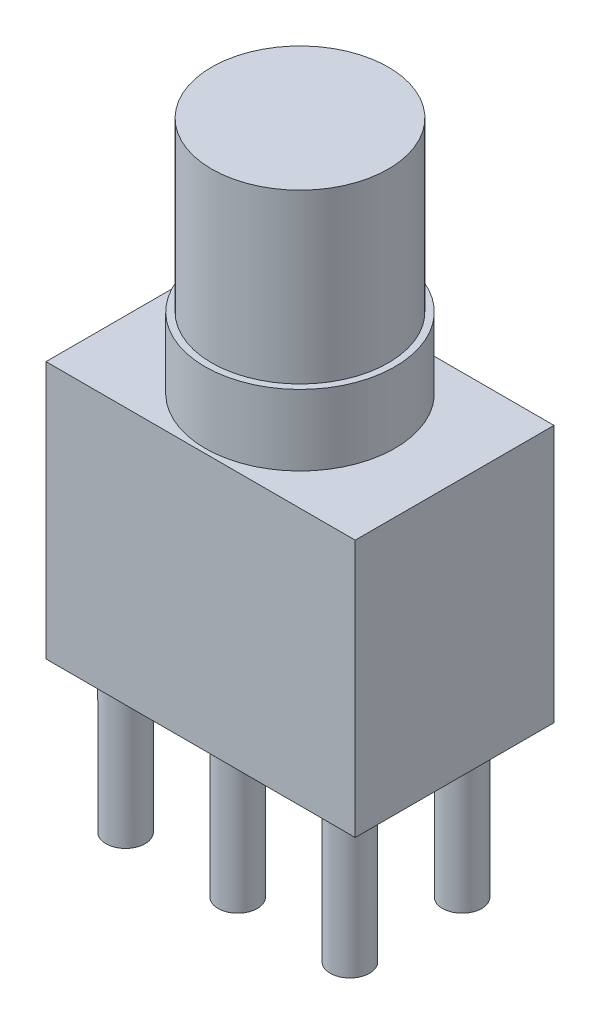
ISO-10303-21;
HEADER;
FILE_DESCRIPTION(('STEP AP214'),'2;1');
FILE_NAME('part.step','',(''),(''),'','','');
FILE_SCHEMA(('AUTOMOTIVE_DESIGN { 1 0 10303 214 1 1 1 1 }'));
ENDSEC;
DATA;
#1=APPLICATION_CONTEXT('core data for automotive mechanical design processes');
#2=APPLICATION_PROTOCOL_DEFINITION('international standard','automotive_design',2000,#1);
#3=PRODUCT_CONTEXT('',#1,'mechanical');
#4=PRODUCT('Part','Part','',(#3));
#5=PRODUCT_RELATED_PRODUCT_CATEGORY('part','',(#4));
#6=PRODUCT_DEFINITION_FORMATION('','',#4);
#7=PRODUCT_DEFINITION_CONTEXT('part definition',#1,'design');
#8=PRODUCT_DEFINITION('design','',#6,#7);
#9=PRODUCT_DEFINITION_SHAPE('','',#8);
#10=(LENGTH_UNIT() NAMED_UNIT(*) SI_UNIT(.MILLI.,.METRE.));
#11=(NAMED_UNIT(*) PLANE_ANGLE_UNIT() SI_UNIT($,.RADIAN.));
#12=(NAMED_UNIT(*) SI_UNIT($,.STERADIAN.) SOLID_ANGLE_UNIT());
#13=UNCERTAINTY_MEASURE_WITH_UNIT(LENGTH_MEASURE(1.E-05),#10,'distance_accuracy_value','');
#14=(GEOMETRIC_REPRESENTATION_CONTEXT(3) GLOBAL_UNCERTAINTY_ASSIGNED_CONTEXT((#13)) GLOBAL_UNIT_ASSIGNED_CONTEXT((#10,
#11,#12)) REPRESENTATION_CONTEXT('',''));
#15=CARTESIAN_POINT('',(0.,0.,0.));
#16=DIRECTION('',(0.,0.,1.));
#17=DIRECTION('',(1.,0.,0.));
#18=AXIS2_PLACEMENT_3D('',#15,#16,#17);
#19=CARTESIAN_POINT('',(0.,5.83,0.));
#20=DIRECTION('',(1.,0.,0.));
#21=DIRECTION('',(0.,0.,-1.));
#22=AXIS2_PLACEMENT_3D('',#19,#20,#21);
#23=PLANE('',#22);
#24=DIRECTION('',(0.,0.,1.));
#25=VECTOR('',#24,1.);
#26=CARTESIAN_POINT('',(0.,0.,0.));
#27=LINE('',#26,#25);
#28=CARTESIAN_POINT('',(0.,0.,0.));
#29=VERTEX_POINT('',#28);
#30=CARTESIAN_POINT('',(0.,0.,4.5));
#31=VERTEX_POINT('',#30);
#32=EDGE_CURVE('E100',#29,#31,#27,.T.);
#33=ORIENTED_EDGE('',*,*,#32,.T.);
#34=DIRECTION('',(0.,-1.,0.));
#35=VECTOR('',#34,1.);
#36=CARTESIAN_POINT('',(0.,5.83,4.5));
#37=LINE('',#36,#35);
#38=CARTESIAN_POINT('',(0.,5.83,4.5));
#39=VERTEX_POINT('',#38);
#40=EDGE_CURVE('E91',#39,#31,#37,.T.);
#41=ORIENTED_EDGE('',*,*,#40,.F.);
#42=DIRECTION('',(0.,0.,1.));
#43=VECTOR('',#42,1.);
#44=CARTESIAN_POINT('',(0.,5.83,0.));
#45=LINE('',#44,#43);
#46=CARTESIAN_POINT('',(0.,5.83,0.));
#47=VERTEX_POINT('',#46);
#48=EDGE_CURVE('E85',#47,#39,#45,.T.);
#49=ORIENTED_EDGE('',*,*,#48,.F.);
#50=DIRECTION('',(0.,-1.,0.));
#51=VECTOR('',#50,1.);
#52=CARTESIAN_POINT('',(0.,5.83,0.));
#53=LINE('',#52,#51);
#54=EDGE_CURVE('E96',#47,#29,#53,.T.);
#55=ORIENTED_EDGE('',*,*,#54,.T.);
#56=EDGE_LOOP('',(#33,#41,#49,#55));
#57=FACE_BOUND('',#56,.T.);
#58=ADVANCED_FACE('F33',(#57),#23,.F.);
#59=CARTESIAN_POINT('',(0.,5.83,4.5));
#60=DIRECTION('',(0.,0.,-1.));
#61=DIRECTION('',(-1.,0.,0.));
#62=AXIS2_PLACEMENT_3D('',#59,#60,#61);
#63=PLANE('',#62);
#64=DIRECTION('',(1.,0.,0.));
#65=VECTOR('',#64,1.);
#66=CARTESIAN_POINT('',(0.,0.,4.5));
#67=LINE('',#66,#65);
#68=CARTESIAN_POINT('',(7.,0.,4.5));
#69=VERTEX_POINT('',#68);
#70=EDGE_CURVE('E90',#31,#69,#67,.T.);
#71=ORIENTED_EDGE('',*,*,#70,.T.);
#72=DIRECTION('',(0.,-1.,0.));
#73=VECTOR('',#72,1.);
#74=CARTESIAN_POINT('',(7.,5.83,4.5));
#75=LINE('',#74,#73);
#76=CARTESIAN_POINT('',(7.,5.83,4.5));
#77=VERTEX_POINT('',#76);
#78=EDGE_CURVE('E88',#77,#69,#75,.T.);
#79=ORIENTED_EDGE('',*,*,#78,.F.);
#80=DIRECTION('',(1.,0.,0.));
#81=VECTOR('',#80,1.);
#82=CARTESIAN_POINT('',(0.,5.83,4.5));
#83=LINE('',#82,#81);
#84=EDGE_CURVE('E80',#39,#77,#83,.T.);
#85=ORIENTED_EDGE('',*,*,#84,.F.);
#86=ORIENTED_EDGE('',*,*,#40,.T.);
#87=EDGE_LOOP('',(#71,#79,#85,#86));
#88=FACE_BOUND('',#87,.T.);
#89=ADVANCED_FACE('F89',(#88),#63,.F.);
#90=CARTESIAN_POINT('',(7.,5.83,0.));
#91=DIRECTION('',(-1.,0.,0.));
#92=DIRECTION('',(0.,0.,1.));
#93=AXIS2_PLACEMENT_3D('',#90,#91,#92);
#94=PLANE('',#93);
#95=DIRECTION('',(0.,0.,-1.));
#96=VECTOR('',#95,1.);
#97=CARTESIAN_POINT('',(7.,0.,0.));
#98=LINE('',#97,#96);
#99=CARTESIAN_POINT('',(7.,0.,0.));
#100=VERTEX_POINT('',#99);
#101=EDGE_CURVE('E66',#69,#100,#98,.T.);
#102=ORIENTED_EDGE('',*,*,#101,.T.);
#103=DIRECTION('',(0.,-1.,0.));
#104=VECTOR('',#103,1.);
#105=CARTESIAN_POINT('',(7.,5.83,0.));
#106=LINE('',#105,#104);
#107=CARTESIAN_POINT('',(7.,5.83,0.));
#108=VERTEX_POINT('',#107);
#109=EDGE_CURVE('E92',#108,#100,#106,.T.);
#110=ORIENTED_EDGE('',*,*,#109,.F.);
#111=DIRECTION('',(0.,0.,-1.));
#112=VECTOR('',#111,1.);
#113=CARTESIAN_POINT('',(7.,5.83,0.));
#114=LINE('',#113,#112);
#115=EDGE_CURVE('E83',#77,#108,#114,.T.);
#116=ORIENTED_EDGE('',*,*,#115,.F.);
#117=ORIENTED_EDGE('',*,*,#78,.T.);
#118=EDGE_LOOP('',(#102,#110,#116,#117));
#119=FACE_BOUND('',#118,.T.);
#120=ADVANCED_FACE('F94',(#119),#94,.F.);
#121=CARTESIAN_POINT('',(0.,5.83,0.));
#122=DIRECTION('',(0.,0.,1.));
#123=DIRECTION('',(1.,0.,0.));
#124=AXIS2_PLACEMENT_3D('',#121,#122,#123);
#125=PLANE('',#124);
#126=DIRECTION('',(-1.,0.,0.));
#127=VECTOR('',#126,1.);
#128=CARTESIAN_POINT('',(0.,0.,0.));
#129=LINE('',#128,#127);
#130=EDGE_CURVE('E72',#100,#29,#129,.T.);
#131=ORIENTED_EDGE('',*,*,#130,.T.);
#132=ORIENTED_EDGE('',*,*,#54,.F.);
#133=DIRECTION('',(-1.,0.,0.));
#134=VECTOR('',#133,1.);
#135=CARTESIAN_POINT('',(0.,5.83,0.));
#136=LINE('',#135,#134);
#137=EDGE_CURVE('E49',#108,#47,#136,.T.);
#138=ORIENTED_EDGE('',*,*,#137,.F.);
#139=ORIENTED_EDGE('',*,*,#109,.T.);
#140=EDGE_LOOP('',(#131,#132,#138,#139));
#141=FACE_BOUND('',#140,.T.);
#142=ADVANCED_FACE('F144',(#141),#125,.F.);
#143=CARTESIAN_POINT('',(0.,5.83,0.));
#144=DIRECTION('',(0.,1.,0.));
#145=DIRECTION('',(0.,0.,1.));
#146=AXIS2_PLACEMENT_3D('',#143,#144,#145);
#147=PLANE('',#146);
#148=CARTESIAN_POINT('',(3.5,5.83,2.25));
#149=DIRECTION('',(0.,1.,0.));
#150=DIRECTION('',(0.,0.,1.));
#151=AXIS2_PLACEMENT_3D('',#148,#149,#150);
#152=CIRCLE('',#151,2.15);
#153=CARTESIAN_POINT('',(3.5,5.83,4.4));
#154=VERTEX_POINT('',#153);
#155=EDGE_CURVE('E110',#154,#154,#152,.T.);
#156=ORIENTED_EDGE('',*,*,#155,.F.);
#157=EDGE_LOOP('',(#156));
#158=FACE_BOUND('',#157,.T.);
#159=ORIENTED_EDGE('',*,*,#48,.T.);
#160=ORIENTED_EDGE('',*,*,#84,.T.);
#161=ORIENTED_EDGE('',*,*,#115,.T.);
#162=ORIENTED_EDGE('',*,*,#137,.T.);
#163=EDGE_LOOP('',(#159,#160,#161,#162));
#164=FACE_BOUND('',#163,.T.);
#165=ADVANCED_FACE('F81',(#158,#164),#147,.T.);
#166=CARTESIAN_POINT('',(0.,0.,0.));
#167=DIRECTION('',(0.,1.,0.));
#168=DIRECTION('',(0.,0.,1.));
#169=AXIS2_PLACEMENT_3D('',#166,#167,#168);
#170=PLANE('',#169);
#171=CARTESIAN_POINT('',(1.,0.,1.16));
#172=DIRECTION('',(0.,1.,0.));
#173=DIRECTION('',(0.,0.,1.));
#174=AXIS2_PLACEMENT_3D('',#171,#172,#173);
#175=CIRCLE('',#174,0.445000000000001);
#176=CARTESIAN_POINT('',(1.,0.,1.605));
#177=VERTEX_POINT('',#176);
#178=EDGE_CURVE('E11',#177,#177,#175,.F.);
#179=ORIENTED_EDGE('',*,*,#178,.F.);
#180=EDGE_LOOP('',(#179));
#181=FACE_BOUND('',#180,.T.);
#182=CARTESIAN_POINT('',(3.54,0.,1.16));
#183=DIRECTION('',(0.,1.,0.));
#184=DIRECTION('',(0.,0.,1.));
#185=AXIS2_PLACEMENT_3D('',#182,#183,#184);
#186=CIRCLE('',#185,0.445000000000001);
#187=CARTESIAN_POINT('',(3.54,0.,1.605));
#188=VERTEX_POINT('',#187);
#189=EDGE_CURVE('E41',#188,#188,#186,.F.);
#190=ORIENTED_EDGE('',*,*,#189,.F.);
#191=EDGE_LOOP('',(#190));
#192=FACE_BOUND('',#191,.T.);
#193=CARTESIAN_POINT('',(6.08,0.,1.16));
#194=DIRECTION('',(0.,1.,0.));
#195=DIRECTION('',(0.,0.,1.));
#196=AXIS2_PLACEMENT_3D('',#193,#194,#195);
#197=CIRCLE('',#196,0.445);
#198=CARTESIAN_POINT('',(6.08,0.,1.605));
#199=VERTEX_POINT('',#198);
#200=EDGE_CURVE('E121',#199,#199,#197,.F.);
#201=ORIENTED_EDGE('',*,*,#200,.F.);
#202=EDGE_LOOP('',(#201));
#203=FACE_BOUND('',#202,.T.);
#204=CARTESIAN_POINT('',(6.08,0.,3.7));
#205=DIRECTION('',(0.,1.,0.));
#206=DIRECTION('',(0.,0.,1.));
#207=AXIS2_PLACEMENT_3D('',#204,#205,#206);
#208=CIRCLE('',#207,0.445);
#209=CARTESIAN_POINT('',(6.08,0.,4.145));
#210=VERTEX_POINT('',#209);
#211=EDGE_CURVE('E118',#210,#210,#208,.F.);
#212=ORIENTED_EDGE('',*,*,#211,.F.);
#213=EDGE_LOOP('',(#212));
#214=FACE_BOUND('',#213,.T.);
#215=CARTESIAN_POINT('',(3.54,0.,3.7));
#216=DIRECTION('',(0.,1.,0.));
#217=DIRECTION('',(0.,0.,1.));
#218=AXIS2_PLACEMENT_3D('',#215,#216,#217);
#219=CIRCLE('',#218,0.445000000000001);
#220=CARTESIAN_POINT('',(3.54,0.,4.145));
#221=VERTEX_POINT('',#220);
#222=EDGE_CURVE('E114',#221,#221,#219,.F.);
#223=ORIENTED_EDGE('',*,*,#222,.F.);
#224=EDGE_LOOP('',(#223));
#225=FACE_BOUND('',#224,.T.);
#226=CARTESIAN_POINT('',(1.,0.,3.7));
#227=DIRECTION('',(0.,1.,0.));
#228=DIRECTION('',(0.,0.,1.));
#229=AXIS2_PLACEMENT_3D('',#226,#227,#228);
#230=CIRCLE('',#229,0.445000000000001);
#231=CARTESIAN_POINT('',(1.,0.,4.145));
#232=VERTEX_POINT('',#231);
#233=EDGE_CURVE('E111',#232,#232,#230,.F.);
#234=ORIENTED_EDGE('',*,*,#233,.F.);
#235=EDGE_LOOP('',(#234));
#236=FACE_BOUND('',#235,.T.);
#237=ORIENTED_EDGE('',*,*,#32,.F.);
#238=ORIENTED_EDGE('',*,*,#130,.F.);
#239=ORIENTED_EDGE('',*,*,#101,.F.);
#240=ORIENTED_EDGE('',*,*,#70,.F.);
#241=EDGE_LOOP('',(#237,#238,#239,#240));
#242=FACE_BOUND('',#241,.T.);
#243=ADVANCED_FACE('F128',(#181,#192,#203,#214,#225,#236,#242),#170,.F.);
#244=CARTESIAN_POINT('',(3.5,7.43,2.25));
#245=DIRECTION('',(0.,-1.,0.));
#246=DIRECTION('',(0.,0.,-1.));
#247=AXIS2_PLACEMENT_3D('',#244,#245,#246);
#248=CYLINDRICAL_SURFACE('',#247,2.15);
#249=CARTESIAN_POINT('',(3.5,7.43,2.25));
#250=DIRECTION('',(0.,1.,0.));
#251=DIRECTION('',(0.,0.,1.));
#252=AXIS2_PLACEMENT_3D('',#249,#250,#251);
#253=CIRCLE('',#252,2.15);
#254=CARTESIAN_POINT('',(3.5,7.43,4.4));
#255=VERTEX_POINT('',#254);
#256=EDGE_CURVE('E103',#255,#255,#253,.T.);
#257=ORIENTED_EDGE('',*,*,#256,.F.);
#258=EDGE_LOOP('',(#257));
#259=FACE_BOUND('',#258,.T.);
#260=ORIENTED_EDGE('',*,*,#155,.T.);
#261=EDGE_LOOP('',(#260));
#262=FACE_BOUND('',#261,.T.);
#263=ADVANCED_FACE('F131',(#259,#262),#248,.T.);
#264=CARTESIAN_POINT('',(3.5,7.43,2.25));
#265=DIRECTION('',(0.,1.,0.));
#266=DIRECTION('',(0.,0.,1.));
#267=AXIS2_PLACEMENT_3D('',#264,#265,#266);
#268=PLANE('',#267);
#269=CARTESIAN_POINT('',(3.5,7.43,2.25));
#270=DIRECTION('',(0.,1.,0.));
#271=DIRECTION('',(0.,0.,1.));
#272=AXIS2_PLACEMENT_3D('',#269,#270,#271);
#273=CIRCLE('',#272,2.);
#274=CARTESIAN_POINT('',(3.5,7.43,4.25));
#275=VERTEX_POINT('',#274);
#276=EDGE_CURVE('E115',#275,#275,#273,.T.);
#277=ORIENTED_EDGE('',*,*,#276,.F.);
#278=EDGE_LOOP('',(#277));
#279=FACE_BOUND('',#278,.T.);
#280=ORIENTED_EDGE('',*,*,#256,.T.);
#281=EDGE_LOOP('',(#280));
#282=FACE_BOUND('',#281,.T.);
#283=ADVANCED_FACE('F184',(#279,#282),#268,.T.);
#284=CARTESIAN_POINT('',(3.5,11.23,2.25));
#285=DIRECTION('',(0.,-1.,0.));
#286=DIRECTION('',(0.,0.,-1.));
#287=AXIS2_PLACEMENT_3D('',#284,#285,#286);
#288=CYLINDRICAL_SURFACE('',#287,2.);
#289=CARTESIAN_POINT('',(3.5,11.23,2.25));
#290=DIRECTION('',(0.,1.,0.));
#291=DIRECTION('',(0.,0.,1.));
#292=AXIS2_PLACEMENT_3D('',#289,#290,#291);
#293=CIRCLE('',#292,2.);
#294=CARTESIAN_POINT('',(3.5,11.23,4.25));
#295=VERTEX_POINT('',#294);
#296=EDGE_CURVE('E362',#295,#295,#293,.T.);
#297=ORIENTED_EDGE('',*,*,#296,.F.);
#298=EDGE_LOOP('',(#297));
#299=FACE_BOUND('',#298,.T.);
#300=ORIENTED_EDGE('',*,*,#276,.T.);
#301=EDGE_LOOP('',(#300));
#302=FACE_BOUND('',#301,.T.);
#303=ADVANCED_FACE('F194',(#299,#302),#288,.T.);
#304=CARTESIAN_POINT('',(3.5,11.23,2.25));
#305=DIRECTION('',(0.,1.,0.));
#306=DIRECTION('',(0.,0.,1.));
#307=AXIS2_PLACEMENT_3D('',#304,#305,#306);
#308=PLANE('',#307);
#309=ORIENTED_EDGE('',*,*,#296,.T.);
#310=EDGE_LOOP('',(#309));
#311=FACE_BOUND('',#310,.T.);
#312=ADVANCED_FACE('F204',(#311),#308,.T.);
#313=CARTESIAN_POINT('',(1.,-3.3,3.7));
#314=DIRECTION('',(0.,1.,0.));
#315=DIRECTION('',(0.,0.,1.));
#316=AXIS2_PLACEMENT_3D('',#313,#314,#315);
#317=CYLINDRICAL_SURFACE('',#316,0.445000000000001);
#318=CARTESIAN_POINT('',(1.,-3.3,3.7));
#319=DIRECTION('',(0.,-1.,0.));
#320=DIRECTION('',(0.,0.,-1.));
#321=AXIS2_PLACEMENT_3D('',#318,#319,#320);
#322=CIRCLE('',#321,0.445000000000001);
#323=CARTESIAN_POINT('',(1.,-3.3,3.255));
#324=VERTEX_POINT('',#323);
#325=EDGE_CURVE('E359',#324,#324,#322,.T.);
#326=ORIENTED_EDGE('',*,*,#325,.F.);
#327=EDGE_LOOP('',(#326));
#328=FACE_BOUND('',#327,.T.);
#329=ORIENTED_EDGE('',*,*,#233,.T.);
#330=EDGE_LOOP('',(#329));
#331=FACE_BOUND('',#330,.T.);
#332=ADVANCED_FACE('F214',(#328,#331),#317,.T.);
#333=CARTESIAN_POINT('',(1.,-3.3,3.7));
#334=DIRECTION('',(0.,-1.,0.));
#335=DIRECTION('',(0.,0.,-1.));
#336=AXIS2_PLACEMENT_3D('',#333,#334,#335);
#337=PLANE('',#336);
#338=ORIENTED_EDGE('',*,*,#325,.T.);
#339=EDGE_LOOP('',(#338));
#340=FACE_BOUND('',#339,.T.);
#341=ADVANCED_FACE('F229',(#340),#337,.T.);
#342=CARTESIAN_POINT('',(3.54,-3.3,3.7));
#343=DIRECTION('',(0.,1.,0.));
#344=DIRECTION('',(0.,0.,1.));
#345=AXIS2_PLACEMENT_3D('',#342,#343,#344);
#346=CYLINDRICAL_SURFACE('',#345,0.445000000000001);
#347=CARTESIAN_POINT('',(3.54,-3.3,3.7));
#348=DIRECTION('',(0.,-1.,0.));
#349=DIRECTION('',(0.,0.,-1.));
#350=AXIS2_PLACEMENT_3D('',#347,#348,#349);
#351=CIRCLE('',#350,0.445000000000001);
#352=CARTESIAN_POINT('',(3.54,-3.3,3.255));
#353=VERTEX_POINT('',#352);
#354=EDGE_CURVE('E356',#353,#353,#351,.T.);
#355=ORIENTED_EDGE('',*,*,#354,.F.);
#356=EDGE_LOOP('',(#355));
#357=FACE_BOUND('',#356,.T.);
#358=ORIENTED_EDGE('',*,*,#222,.T.);
#359=EDGE_LOOP('',(#358));
#360=FACE_BOUND('',#359,.T.);
#361=ADVANCED_FACE('F239',(#357,#360),#346,.T.);
#362=CARTESIAN_POINT('',(3.54,-3.3,3.7));
#363=DIRECTION('',(0.,-1.,0.));
#364=DIRECTION('',(0.,0.,-1.));
#365=AXIS2_PLACEMENT_3D('',#362,#363,#364);
#366=PLANE('',#365);
#367=ORIENTED_EDGE('',*,*,#354,.T.);
#368=EDGE_LOOP('',(#367));
#369=FACE_BOUND('',#368,.T.);
#370=ADVANCED_FACE('F249',(#369),#366,.T.);
#371=CARTESIAN_POINT('',(6.08,-3.3,3.7));
#372=DIRECTION('',(0.,1.,0.));
#373=DIRECTION('',(0.,0.,1.));
#374=AXIS2_PLACEMENT_3D('',#371,#372,#373);
#375=CYLINDRICAL_SURFACE('',#374,0.445);
#376=CARTESIAN_POINT('',(6.08,-3.3,3.7));
#377=DIRECTION('',(0.,-1.,0.));
#378=DIRECTION('',(0.,0.,-1.));
#379=AXIS2_PLACEMENT_3D('',#376,#377,#378);
#380=CIRCLE('',#379,0.445);
#381=CARTESIAN_POINT('',(6.08,-3.3,3.255));
#382=VERTEX_POINT('',#381);
#383=EDGE_CURVE('E353',#382,#382,#380,.T.);
#384=ORIENTED_EDGE('',*,*,#383,.F.);
#385=EDGE_LOOP('',(#384));
#386=FACE_BOUND('',#385,.T.);
#387=ORIENTED_EDGE('',*,*,#211,.T.);
#388=EDGE_LOOP('',(#387));
#389=FACE_BOUND('',#388,.T.);
#390=ADVANCED_FACE('F259',(#386,#389),#375,.T.);
#391=CARTESIAN_POINT('',(6.08,-3.3,3.7));
#392=DIRECTION('',(0.,-1.,0.));
#393=DIRECTION('',(0.,0.,-1.));
#394=AXIS2_PLACEMENT_3D('',#391,#392,#393);
#395=PLANE('',#394);
#396=ORIENTED_EDGE('',*,*,#383,.T.);
#397=EDGE_LOOP('',(#396));
#398=FACE_BOUND('',#397,.T.);
#399=ADVANCED_FACE('F269',(#398),#395,.T.);
#400=CARTESIAN_POINT('',(6.08,-3.3,1.16));
#401=DIRECTION('',(0.,1.,0.));
#402=DIRECTION('',(0.,0.,1.));
#403=AXIS2_PLACEMENT_3D('',#400,#401,#402);
#404=CYLINDRICAL_SURFACE('',#403,0.445);
#405=CARTESIAN_POINT('',(6.08,-3.3,1.16));
#406=DIRECTION('',(0.,-1.,0.));
#407=DIRECTION('',(0.,0.,1.));
#408=AXIS2_PLACEMENT_3D('',#405,#406,#407);
#409=CIRCLE('',#408,0.445);
#410=CARTESIAN_POINT('',(6.08,-3.3,1.605));
#411=VERTEX_POINT('',#410);
#412=EDGE_CURVE('E348',#411,#411,#409,.T.);
#413=ORIENTED_EDGE('',*,*,#412,.F.);
#414=EDGE_LOOP('',(#413));
#415=FACE_BOUND('',#414,.T.);
#416=ORIENTED_EDGE('',*,*,#200,.T.);
#417=EDGE_LOOP('',(#416));
#418=FACE_BOUND('',#417,.T.);
#419=ADVANCED_FACE('F279',(#415,#418),#404,.T.);
#420=CARTESIAN_POINT('',(6.08,-3.3,1.16));
#421=DIRECTION('',(0.,1.,0.));
#422=DIRECTION('',(0.,0.,1.));
#423=AXIS2_PLACEMENT_3D('',#420,#421,#422);
#424=PLANE('',#423);
#425=ORIENTED_EDGE('',*,*,#412,.T.);
#426=EDGE_LOOP('',(#425));
#427=FACE_BOUND('',#426,.T.);
#428=ADVANCED_FACE('F289',(#427),#424,.F.);
#429=CARTESIAN_POINT('',(3.54,-3.3,1.16));
#430=DIRECTION('',(0.,1.,0.));
#431=DIRECTION('',(0.,0.,1.));
#432=AXIS2_PLACEMENT_3D('',#429,#430,#431);
#433=CYLINDRICAL_SURFACE('',#432,0.445000000000001);
#434=CARTESIAN_POINT('',(3.54,-3.3,1.16));
#435=DIRECTION('',(0.,-1.,0.));
#436=DIRECTION('',(0.,0.,1.));
#437=AXIS2_PLACEMENT_3D('',#434,#435,#436);
#438=CIRCLE('',#437,0.445000000000001);
#439=CARTESIAN_POINT('',(3.54,-3.3,1.605));
#440=VERTEX_POINT('',#439);
#441=EDGE_CURVE('E345',#440,#440,#438,.T.);
#442=ORIENTED_EDGE('',*,*,#441,.F.);
#443=EDGE_LOOP('',(#442));
#444=FACE_BOUND('',#443,.T.);
#445=ORIENTED_EDGE('',*,*,#189,.T.);
#446=EDGE_LOOP('',(#445));
#447=FACE_BOUND('',#446,.T.);
#448=ADVANCED_FACE('F126',(#444,#447),#433,.T.);
#449=CARTESIAN_POINT('',(3.54,-3.3,1.16));
#450=DIRECTION('',(0.,1.,0.));
#451=DIRECTION('',(0.,0.,1.));
#452=AXIS2_PLACEMENT_3D('',#449,#450,#451);
#453=PLANE('',#452);
#454=ORIENTED_EDGE('',*,*,#441,.T.);
#455=EDGE_LOOP('',(#454));
#456=FACE_BOUND('',#455,.T.);
#457=ADVANCED_FACE('F308',(#456),#453,.F.);
#458=CARTESIAN_POINT('',(1.,-3.3,1.16));
#459=DIRECTION('',(0.,1.,0.));
#460=DIRECTION('',(0.,0.,1.));
#461=AXIS2_PLACEMENT_3D('',#458,#459,#460);
#462=CYLINDRICAL_SURFACE('',#461,0.445000000000001);
#463=CARTESIAN_POINT('',(1.,-3.3,1.16));
#464=DIRECTION('',(0.,-1.,0.));
#465=DIRECTION('',(0.,0.,1.));
#466=AXIS2_PLACEMENT_3D('',#463,#464,#465);
#467=CIRCLE('',#466,0.445000000000001);
#468=CARTESIAN_POINT('',(1.,-3.3,1.605));
#469=VERTEX_POINT('',#468);
#470=EDGE_CURVE('E344',#469,#469,#467,.T.);
#471=ORIENTED_EDGE('',*,*,#470,.F.);
#472=EDGE_LOOP('',(#471));
#473=FACE_BOUND('',#472,.T.);
#474=ORIENTED_EDGE('',*,*,#178,.T.);
#475=EDGE_LOOP('',(#474));
#476=FACE_BOUND('',#475,.T.);
#477=ADVANCED_FACE('F318',(#473,#476),#462,.T.);
#478=CARTESIAN_POINT('',(1.,-3.3,1.16));
#479=DIRECTION('',(0.,1.,0.));
#480=DIRECTION('',(0.,0.,1.));
#481=AXIS2_PLACEMENT_3D('',#478,#479,#480);
#482=PLANE('',#481);
#483=ORIENTED_EDGE('',*,*,#470,.T.);
#484=EDGE_LOOP('',(#483));
#485=FACE_BOUND('',#484,.T.);
#486=ADVANCED_FACE('F328',(#485),#482,.F.);
#487=CLOSED_SHELL('',(#58,#89,#120,#142,#165,#243,#263,#283,#303,#312,#332,#341,#361,#370,#390,
#399,#419,#428,#448,#457,#477,#486));
#488=MANIFOLD_SOLID_BREP('B2',#487);
#489=ADVANCED_BREP_SHAPE_REPRESENTATION('',(#18,#488),#14);
#490=SHAPE_DEFINITION_REPRESENTATION(#9,#489);
ENDSEC;
END-ISO-10303-21;
